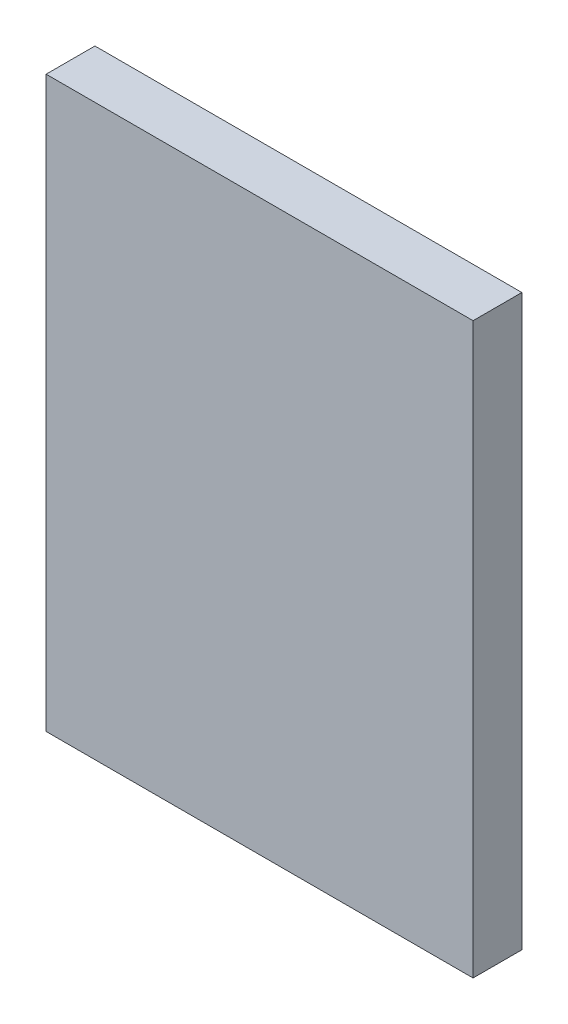
ISO-10303-21;
HEADER;
FILE_DESCRIPTION(('STEP AP214'),'2;1');
FILE_NAME('part.step','',(''),(''),'','','');
FILE_SCHEMA(('AUTOMOTIVE_DESIGN { 1 0 10303 214 1 1 1 1 }'));
ENDSEC;
DATA;
#1=APPLICATION_CONTEXT('core data for automotive mechanical design processes');
#2=APPLICATION_PROTOCOL_DEFINITION('international standard','automotive_design',2000,#1);
#3=PRODUCT_CONTEXT('',#1,'mechanical');
#4=PRODUCT('Part','Part','',(#3));
#5=PRODUCT_RELATED_PRODUCT_CATEGORY('part','',(#4));
#6=PRODUCT_DEFINITION_FORMATION('','',#4);
#7=PRODUCT_DEFINITION_CONTEXT('part definition',#1,'design');
#8=PRODUCT_DEFINITION('design','',#6,#7);
#9=PRODUCT_DEFINITION_SHAPE('','',#8);
#10=(LENGTH_UNIT() NAMED_UNIT(*) SI_UNIT(.MILLI.,.METRE.));
#11=(NAMED_UNIT(*) PLANE_ANGLE_UNIT() SI_UNIT($,.RADIAN.));
#12=(NAMED_UNIT(*) SI_UNIT($,.STERADIAN.) SOLID_ANGLE_UNIT());
#13=UNCERTAINTY_MEASURE_WITH_UNIT(LENGTH_MEASURE(1.E-05),#10,'distance_accuracy_value','');
#14=(GEOMETRIC_REPRESENTATION_CONTEXT(3) GLOBAL_UNCERTAINTY_ASSIGNED_CONTEXT((#13)) GLOBAL_UNIT_ASSIGNED_CONTEXT((#10,
#11,#12)) REPRESENTATION_CONTEXT('',''));
#15=CARTESIAN_POINT('',(0.,0.,0.));
#16=DIRECTION('',(0.,0.,1.));
#17=DIRECTION('',(1.,0.,0.));
#18=AXIS2_PLACEMENT_3D('',#15,#16,#17);
#19=CARTESIAN_POINT('',(10.4692,5.12318,0.76487));
#20=DIRECTION('',(0.,0.,-1.));
#21=DIRECTION('',(-1.,0.,0.));
#22=AXIS2_PLACEMENT_3D('',#19,#20,#21);
#23=PLANE('',#22);
#24=DIRECTION('',(1.,0.,0.));
#25=VECTOR('',#24,1.);
#26=CARTESIAN_POINT('',(10.3192,5.32318,0.76487));
#27=LINE('',#26,#25);
#28=CARTESIAN_POINT('',(10.3192,5.32318,0.76487));
#29=VERTEX_POINT('',#28);
#30=CARTESIAN_POINT('',(10.6192,5.32318,0.76487));
#31=VERTEX_POINT('',#30);
#32=EDGE_CURVE('E55',#29,#31,#27,.T.);
#33=ORIENTED_EDGE('',*,*,#32,.T.);
#34=DIRECTION('',(0.,1.,0.));
#35=VECTOR('',#34,1.);
#36=CARTESIAN_POINT('',(10.6192,5.32318,0.76487));
#37=LINE('',#36,#35);
#38=CARTESIAN_POINT('',(10.6192,4.92318,0.76487));
#39=VERTEX_POINT('',#38);
#40=EDGE_CURVE('E57',#31,#39,#37,.F.);
#41=ORIENTED_EDGE('',*,*,#40,.T.);
#42=DIRECTION('',(1.,0.,0.));
#43=VECTOR('',#42,1.);
#44=CARTESIAN_POINT('',(10.6192,4.92318,0.76487));
#45=LINE('',#44,#43);
#46=CARTESIAN_POINT('',(10.3192,4.92318,0.76487));
#47=VERTEX_POINT('',#46);
#48=EDGE_CURVE('E20',#39,#47,#45,.F.);
#49=ORIENTED_EDGE('',*,*,#48,.T.);
#50=DIRECTION('',(0.,1.,0.));
#51=VECTOR('',#50,1.);
#52=CARTESIAN_POINT('',(10.3192,4.92318,0.76487));
#53=LINE('',#52,#51);
#54=EDGE_CURVE('E80',#47,#29,#53,.T.);
#55=ORIENTED_EDGE('',*,*,#54,.T.);
#56=EDGE_LOOP('',(#33,#41,#49,#55));
#57=FACE_BOUND('',#56,.T.);
#58=ADVANCED_FACE('F17',(#57),#23,.T.);
#59=CARTESIAN_POINT('',(10.6192,4.92318,0.76487));
#60=DIRECTION('',(0.,1.,0.));
#61=DIRECTION('',(0.,0.,1.));
#62=AXIS2_PLACEMENT_3D('',#59,#60,#61);
#63=PLANE('',#62);
#64=DIRECTION('',(0.,0.,1.));
#65=VECTOR('',#64,1.);
#66=CARTESIAN_POINT('',(10.3192,4.92318,0.76487));
#67=LINE('',#66,#65);
#68=CARTESIAN_POINT('',(10.3192,4.92318,0.79916));
#69=VERTEX_POINT('',#68);
#70=EDGE_CURVE('E68',#69,#47,#67,.F.);
#71=ORIENTED_EDGE('',*,*,#70,.T.);
#72=ORIENTED_EDGE('',*,*,#48,.F.);
#73=DIRECTION('',(0.,0.,1.));
#74=VECTOR('',#73,1.);
#75=CARTESIAN_POINT('',(10.6192,4.92318,0.76487));
#76=LINE('',#75,#74);
#77=CARTESIAN_POINT('',(10.6192,4.92318,0.79916));
#78=VERTEX_POINT('',#77);
#79=EDGE_CURVE('E63',#39,#78,#76,.T.);
#80=ORIENTED_EDGE('',*,*,#79,.T.);
#81=DIRECTION('',(1.,0.,0.));
#82=VECTOR('',#81,1.);
#83=CARTESIAN_POINT('',(10.4692,4.92318,0.79916));
#84=LINE('',#83,#82);
#85=EDGE_CURVE('E83',#69,#78,#84,.T.);
#86=ORIENTED_EDGE('',*,*,#85,.F.);
#87=EDGE_LOOP('',(#71,#72,#80,#86));
#88=FACE_BOUND('',#87,.T.);
#89=ADVANCED_FACE('F65',(#88),#63,.F.);
#90=CARTESIAN_POINT('',(10.6192,5.32318,0.76487));
#91=DIRECTION('',(-1.,0.,0.));
#92=DIRECTION('',(0.,0.,1.));
#93=AXIS2_PLACEMENT_3D('',#90,#91,#92);
#94=PLANE('',#93);
#95=ORIENTED_EDGE('',*,*,#79,.F.);
#96=ORIENTED_EDGE('',*,*,#40,.F.);
#97=DIRECTION('',(0.,0.,-1.));
#98=VECTOR('',#97,1.);
#99=CARTESIAN_POINT('',(10.6192,5.32318,0.76487));
#100=LINE('',#99,#98);
#101=CARTESIAN_POINT('',(10.6192,5.32318,0.79916));
#102=VERTEX_POINT('',#101);
#103=EDGE_CURVE('E75',#31,#102,#100,.F.);
#104=ORIENTED_EDGE('',*,*,#103,.T.);
#105=DIRECTION('',(0.,-1.,0.));
#106=VECTOR('',#105,1.);
#107=CARTESIAN_POINT('',(10.6192,5.12318,0.79916));
#108=LINE('',#107,#106);
#109=EDGE_CURVE('E72',#78,#102,#108,.F.);
#110=ORIENTED_EDGE('',*,*,#109,.F.);
#111=EDGE_LOOP('',(#95,#96,#104,#110));
#112=FACE_BOUND('',#111,.T.);
#113=ADVANCED_FACE('F70',(#112),#94,.F.);
#114=CARTESIAN_POINT('',(10.3192,5.32318,0.76487));
#115=DIRECTION('',(0.,-1.,0.));
#116=DIRECTION('',(0.,0.,-1.));
#117=AXIS2_PLACEMENT_3D('',#114,#115,#116);
#118=PLANE('',#117);
#119=ORIENTED_EDGE('',*,*,#103,.F.);
#120=ORIENTED_EDGE('',*,*,#32,.F.);
#121=DIRECTION('',(0.,0.,1.));
#122=VECTOR('',#121,1.);
#123=CARTESIAN_POINT('',(10.3192,5.32318,0.76487));
#124=LINE('',#123,#122);
#125=CARTESIAN_POINT('',(10.3192,5.32318,0.79916));
#126=VERTEX_POINT('',#125);
#127=EDGE_CURVE('E35',#29,#126,#124,.T.);
#128=ORIENTED_EDGE('',*,*,#127,.T.);
#129=DIRECTION('',(1.,0.,0.));
#130=VECTOR('',#129,1.);
#131=CARTESIAN_POINT('',(10.4692,5.32318,0.79916));
#132=LINE('',#131,#130);
#133=EDGE_CURVE('E26',#102,#126,#132,.F.);
#134=ORIENTED_EDGE('',*,*,#133,.F.);
#135=EDGE_LOOP('',(#119,#120,#128,#134));
#136=FACE_BOUND('',#135,.T.);
#137=ADVANCED_FACE('F89',(#136),#118,.F.);
#138=CARTESIAN_POINT('',(10.3192,4.92318,0.76487));
#139=DIRECTION('',(1.,0.,0.));
#140=DIRECTION('',(0.,1.,0.));
#141=AXIS2_PLACEMENT_3D('',#138,#139,#140);
#142=PLANE('',#141);
#143=ORIENTED_EDGE('',*,*,#127,.F.);
#144=ORIENTED_EDGE('',*,*,#54,.F.);
#145=ORIENTED_EDGE('',*,*,#70,.F.);
#146=DIRECTION('',(0.,-1.,0.));
#147=VECTOR('',#146,1.);
#148=CARTESIAN_POINT('',(10.3192,5.12318,0.79916));
#149=LINE('',#148,#147);
#150=EDGE_CURVE('E11',#126,#69,#149,.T.);
#151=ORIENTED_EDGE('',*,*,#150,.F.);
#152=EDGE_LOOP('',(#143,#144,#145,#151));
#153=FACE_BOUND('',#152,.T.);
#154=ADVANCED_FACE('F91',(#153),#142,.F.);
#155=CARTESIAN_POINT('',(10.4692,5.12318,0.79916));
#156=DIRECTION('',(0.,0.,1.));
#157=DIRECTION('',(0.,-1.,0.));
#158=AXIS2_PLACEMENT_3D('',#155,#156,#157);
#159=PLANE('',#158);
#160=ORIENTED_EDGE('',*,*,#133,.T.);
#161=ORIENTED_EDGE('',*,*,#150,.T.);
#162=ORIENTED_EDGE('',*,*,#85,.T.);
#163=ORIENTED_EDGE('',*,*,#109,.T.);
#164=EDGE_LOOP('',(#160,#161,#162,#163));
#165=FACE_BOUND('',#164,.T.);
#166=ADVANCED_FACE('F88',(#165),#159,.T.);
#167=CLOSED_SHELL('',(#58,#89,#113,#137,#154,#166));
#168=MANIFOLD_SOLID_BREP('B1',#167);
#169=ADVANCED_BREP_SHAPE_REPRESENTATION('',(#18,#168),#14);
#170=SHAPE_DEFINITION_REPRESENTATION(#9,#169);
ENDSEC;
END-ISO-10303-21;
